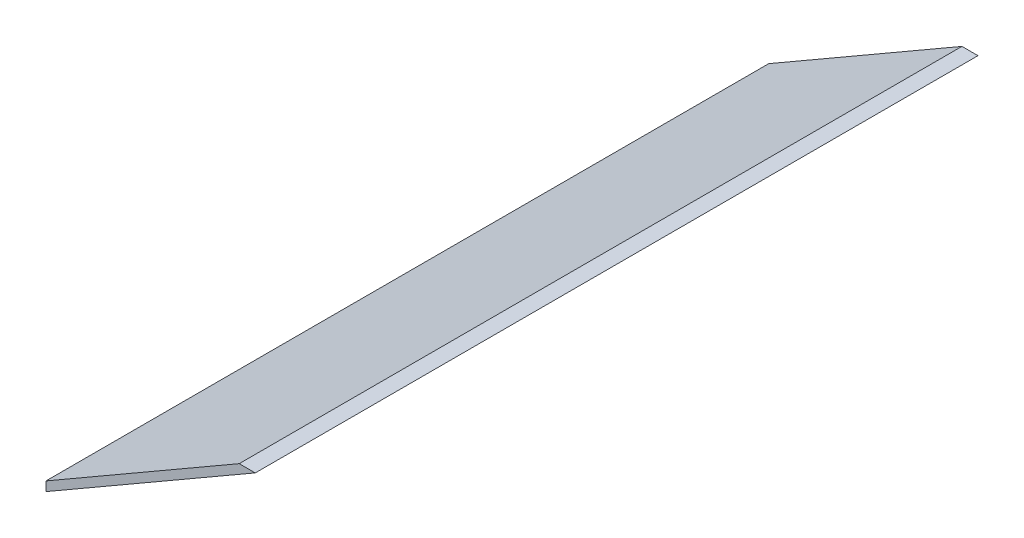
ISO-10303-21;
HEADER;
FILE_DESCRIPTION(('STEP AP214'),'2;1');
FILE_NAME('part.step','',(''),(''),'','','');
FILE_SCHEMA(('AUTOMOTIVE_DESIGN { 1 0 10303 214 1 1 1 1 }'));
ENDSEC;
DATA;
#1=APPLICATION_CONTEXT('core data for automotive mechanical design processes');
#2=APPLICATION_PROTOCOL_DEFINITION('international standard','automotive_design',2000,#1);
#3=PRODUCT_CONTEXT('',#1,'mechanical');
#4=PRODUCT('Part','Part','',(#3));
#5=PRODUCT_RELATED_PRODUCT_CATEGORY('part','',(#4));
#6=PRODUCT_DEFINITION_FORMATION('','',#4);
#7=PRODUCT_DEFINITION_CONTEXT('part definition',#1,'design');
#8=PRODUCT_DEFINITION('design','',#6,#7);
#9=PRODUCT_DEFINITION_SHAPE('','',#8);
#10=(LENGTH_UNIT() NAMED_UNIT(*) SI_UNIT(.MILLI.,.METRE.));
#11=(NAMED_UNIT(*) PLANE_ANGLE_UNIT() SI_UNIT($,.RADIAN.));
#12=(NAMED_UNIT(*) SI_UNIT($,.STERADIAN.) SOLID_ANGLE_UNIT());
#13=UNCERTAINTY_MEASURE_WITH_UNIT(LENGTH_MEASURE(1.E-05),#10,'distance_accuracy_value','');
#14=(GEOMETRIC_REPRESENTATION_CONTEXT(3) GLOBAL_UNCERTAINTY_ASSIGNED_CONTEXT((#13)) GLOBAL_UNIT_ASSIGNED_CONTEXT((#10,
#11,#12)) REPRESENTATION_CONTEXT('',''));
#15=CARTESIAN_POINT('',(0.,0.,0.));
#16=DIRECTION('',(0.,0.,1.));
#17=DIRECTION('',(1.,0.,0.));
#18=AXIS2_PLACEMENT_3D('',#15,#16,#17);
#19=CARTESIAN_POINT('',(97.5,182.5,450.));
#20=DIRECTION('',(-0.5,0.866025403784439,0.));
#21=DIRECTION('',(-0.866025403784439,-0.5,0.));
#22=AXIS2_PLACEMENT_3D('',#19,#20,#21);
#23=PLANE('',#22);
#24=DIRECTION('',(0.866025403784439,0.5,0.));
#25=VECTOR('',#24,1.);
#26=CARTESIAN_POINT('',(97.5,182.5,0.));
#27=LINE('',#26,#25);
#28=CARTESIAN_POINT('',(97.5,182.5,0.));
#29=VERTEX_POINT('',#28);
#30=CARTESIAN_POINT('',(227.804485184357,257.731329597804,0.));
#31=VERTEX_POINT('',#30);
#32=EDGE_CURVE('E96',#29,#31,#27,.T.);
#33=ORIENTED_EDGE('',*,*,#32,.T.);
#34=DIRECTION('',(0.,0.,-1.));
#35=VECTOR('',#34,1.);
#36=CARTESIAN_POINT('',(227.804485184357,257.731329597804,450.));
#37=LINE('',#36,#35);
#38=CARTESIAN_POINT('',(227.804485184357,257.731329597804,450.));
#39=VERTEX_POINT('',#38);
#40=EDGE_CURVE('E11',#39,#31,#37,.T.);
#41=ORIENTED_EDGE('',*,*,#40,.F.);
#42=DIRECTION('',(0.866025403784439,0.5,0.));
#43=VECTOR('',#42,1.);
#44=CARTESIAN_POINT('',(97.5,182.5,450.));
#45=LINE('',#44,#43);
#46=CARTESIAN_POINT('',(97.5,182.5,450.));
#47=VERTEX_POINT('',#46);
#48=EDGE_CURVE('E84',#47,#39,#45,.T.);
#49=ORIENTED_EDGE('',*,*,#48,.F.);
#50=DIRECTION('',(0.,0.,-1.));
#51=VECTOR('',#50,1.);
#52=CARTESIAN_POINT('',(97.5,182.5,450.));
#53=LINE('',#52,#51);
#54=EDGE_CURVE('E92',#47,#29,#53,.T.);
#55=ORIENTED_EDGE('',*,*,#54,.T.);
#56=EDGE_LOOP('',(#33,#41,#49,#55));
#57=FACE_BOUND('',#56,.T.);
#58=ADVANCED_FACE('F33',(#57),#23,.F.);
#59=CARTESIAN_POINT('',(227.804485184357,257.731329597804,450.));
#60=DIRECTION('',(0.,-1.,0.));
#61=DIRECTION('',(0.,0.,-1.));
#62=AXIS2_PLACEMENT_3D('',#59,#60,#61);
#63=PLANE('',#62);
#64=DIRECTION('',(-1.,0.,0.));
#65=VECTOR('',#64,1.);
#66=CARTESIAN_POINT('',(227.804485184357,257.731329597804,0.));
#67=LINE('',#66,#65);
#68=CARTESIAN_POINT('',(217.804485184357,257.731329597804,0.));
#69=VERTEX_POINT('',#68);
#70=EDGE_CURVE('E88',#31,#69,#67,.T.);
#71=ORIENTED_EDGE('',*,*,#70,.T.);
#72=DIRECTION('',(0.,0.,-1.));
#73=VECTOR('',#72,1.);
#74=CARTESIAN_POINT('',(217.804485184357,257.731329597804,450.));
#75=LINE('',#74,#73);
#76=CARTESIAN_POINT('',(217.804485184357,257.731329597804,450.));
#77=VERTEX_POINT('',#76);
#78=EDGE_CURVE('E41',#77,#69,#75,.T.);
#79=ORIENTED_EDGE('',*,*,#78,.F.);
#80=DIRECTION('',(-1.,0.,0.));
#81=VECTOR('',#80,1.);
#82=CARTESIAN_POINT('',(227.804485184357,257.731329597804,450.));
#83=LINE('',#82,#81);
#84=EDGE_CURVE('E79',#39,#77,#83,.T.);
#85=ORIENTED_EDGE('',*,*,#84,.F.);
#86=ORIENTED_EDGE('',*,*,#40,.T.);
#87=EDGE_LOOP('',(#71,#79,#85,#86));
#88=FACE_BOUND('',#87,.T.);
#89=ADVANCED_FACE('F87',(#88),#63,.F.);
#90=CARTESIAN_POINT('',(97.5,188.273502691896,450.));
#91=DIRECTION('',(0.5,-0.866025403784439,0.));
#92=DIRECTION('',(0.866025403784439,0.5,0.));
#93=AXIS2_PLACEMENT_3D('',#90,#91,#92);
#94=PLANE('',#93);
#95=DIRECTION('',(-0.866025403784439,-0.5,0.));
#96=VECTOR('',#95,1.);
#97=CARTESIAN_POINT('',(97.5,188.273502691896,0.));
#98=LINE('',#97,#96);
#99=CARTESIAN_POINT('',(97.5,188.273502691896,0.));
#100=VERTEX_POINT('',#99);
#101=EDGE_CURVE('E66',#69,#100,#98,.T.);
#102=ORIENTED_EDGE('',*,*,#101,.T.);
#103=DIRECTION('',(0.,0.,-1.));
#104=VECTOR('',#103,1.);
#105=CARTESIAN_POINT('',(97.5,188.273502691896,450.));
#106=LINE('',#105,#104);
#107=CARTESIAN_POINT('',(97.5,188.273502691896,450.));
#108=VERTEX_POINT('',#107);
#109=EDGE_CURVE('E89',#108,#100,#106,.T.);
#110=ORIENTED_EDGE('',*,*,#109,.F.);
#111=DIRECTION('',(-0.866025403784439,-0.5,0.));
#112=VECTOR('',#111,1.);
#113=CARTESIAN_POINT('',(97.5,188.273502691896,450.));
#114=LINE('',#113,#112);
#115=EDGE_CURVE('E82',#77,#108,#114,.T.);
#116=ORIENTED_EDGE('',*,*,#115,.F.);
#117=ORIENTED_EDGE('',*,*,#78,.T.);
#118=EDGE_LOOP('',(#102,#110,#116,#117));
#119=FACE_BOUND('',#118,.T.);
#120=ADVANCED_FACE('F90',(#119),#94,.F.);
#121=CARTESIAN_POINT('',(97.5,188.273502691896,450.));
#122=DIRECTION('',(1.,0.,0.));
#123=DIRECTION('',(0.,0.,-1.));
#124=AXIS2_PLACEMENT_3D('',#121,#122,#123);
#125=PLANE('',#124);
#126=DIRECTION('',(0.,-1.,0.));
#127=VECTOR('',#126,1.);
#128=CARTESIAN_POINT('',(97.5,188.273502691896,0.));
#129=LINE('',#128,#127);
#130=EDGE_CURVE('E72',#100,#29,#129,.T.);
#131=ORIENTED_EDGE('',*,*,#130,.T.);
#132=ORIENTED_EDGE('',*,*,#54,.F.);
#133=DIRECTION('',(0.,-1.,0.));
#134=VECTOR('',#133,1.);
#135=CARTESIAN_POINT('',(97.5,188.273502691896,450.));
#136=LINE('',#135,#134);
#137=EDGE_CURVE('E49',#108,#47,#136,.T.);
#138=ORIENTED_EDGE('',*,*,#137,.F.);
#139=ORIENTED_EDGE('',*,*,#109,.T.);
#140=EDGE_LOOP('',(#131,#132,#138,#139));
#141=FACE_BOUND('',#140,.T.);
#142=ADVANCED_FACE('F103',(#141),#125,.F.);
#143=CARTESIAN_POINT('',(0.,0.,450.));
#144=DIRECTION('',(0.,0.,-1.));
#145=DIRECTION('',(-1.,0.,0.));
#146=AXIS2_PLACEMENT_3D('',#143,#144,#145);
#147=PLANE('',#146);
#148=ORIENTED_EDGE('',*,*,#48,.T.);
#149=ORIENTED_EDGE('',*,*,#84,.T.);
#150=ORIENTED_EDGE('',*,*,#115,.T.);
#151=ORIENTED_EDGE('',*,*,#137,.T.);
#152=EDGE_LOOP('',(#148,#149,#150,#151));
#153=FACE_BOUND('',#152,.T.);
#154=ADVANCED_FACE('F80',(#153),#147,.F.);
#155=CARTESIAN_POINT('',(0.,0.,0.));
#156=DIRECTION('',(0.,0.,-1.));
#157=DIRECTION('',(-1.,0.,0.));
#158=AXIS2_PLACEMENT_3D('',#155,#156,#157);
#159=PLANE('',#158);
#160=ORIENTED_EDGE('',*,*,#32,.F.);
#161=ORIENTED_EDGE('',*,*,#130,.F.);
#162=ORIENTED_EDGE('',*,*,#101,.F.);
#163=ORIENTED_EDGE('',*,*,#70,.F.);
#164=EDGE_LOOP('',(#160,#161,#162,#163));
#165=FACE_BOUND('',#164,.T.);
#166=ADVANCED_FACE('F106',(#165),#159,.T.);
#167=CLOSED_SHELL('',(#58,#89,#120,#142,#154,#166));
#168=MANIFOLD_SOLID_BREP('B2',#167);
#169=ADVANCED_BREP_SHAPE_REPRESENTATION('',(#18,#168),#14);
#170=SHAPE_DEFINITION_REPRESENTATION(#9,#169);
ENDSEC;
END-ISO-10303-21;
